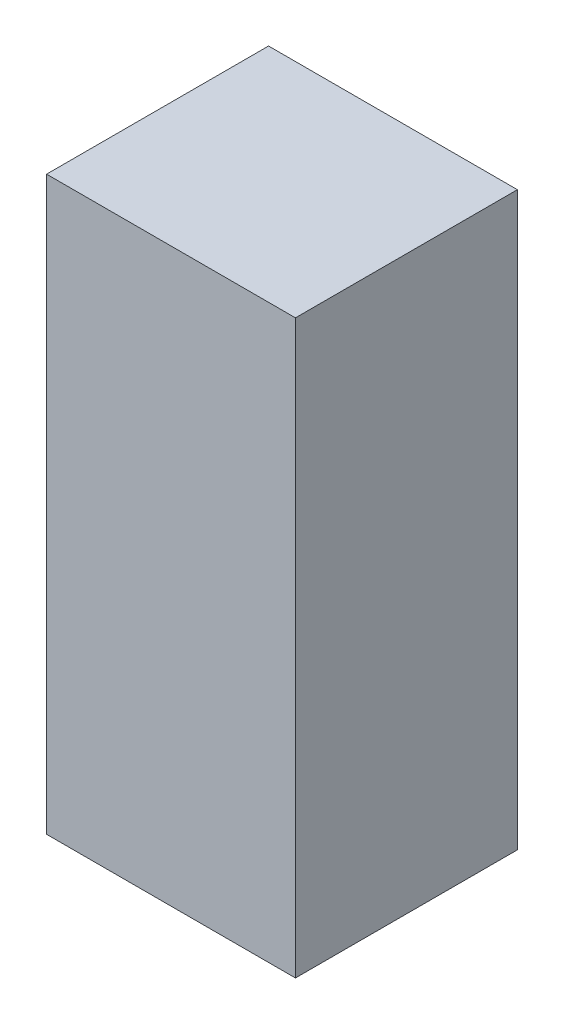
ISO-10303-21;
HEADER;
FILE_DESCRIPTION(('STEP AP214'),'2;1');
FILE_NAME('part.step','',(''),(''),'','','');
FILE_SCHEMA(('AUTOMOTIVE_DESIGN { 1 0 10303 214 1 1 1 1 }'));
ENDSEC;
DATA;
#1=APPLICATION_CONTEXT('core data for automotive mechanical design processes');
#2=APPLICATION_PROTOCOL_DEFINITION('international standard','automotive_design',2000,#1);
#3=PRODUCT_CONTEXT('',#1,'mechanical');
#4=PRODUCT('Part','Part','',(#3));
#5=PRODUCT_RELATED_PRODUCT_CATEGORY('part','',(#4));
#6=PRODUCT_DEFINITION_FORMATION('','',#4);
#7=PRODUCT_DEFINITION_CONTEXT('part definition',#1,'design');
#8=PRODUCT_DEFINITION('design','',#6,#7);
#9=PRODUCT_DEFINITION_SHAPE('','',#8);
#10=(LENGTH_UNIT() NAMED_UNIT(*) SI_UNIT(.MILLI.,.METRE.));
#11=(NAMED_UNIT(*) PLANE_ANGLE_UNIT() SI_UNIT($,.RADIAN.));
#12=(NAMED_UNIT(*) SI_UNIT($,.STERADIAN.) SOLID_ANGLE_UNIT());
#13=UNCERTAINTY_MEASURE_WITH_UNIT(LENGTH_MEASURE(1.E-05),#10,'distance_accuracy_value','');
#14=(GEOMETRIC_REPRESENTATION_CONTEXT(3) GLOBAL_UNCERTAINTY_ASSIGNED_CONTEXT((#13)) GLOBAL_UNIT_ASSIGNED_CONTEXT((#10,
#11,#12)) REPRESENTATION_CONTEXT('',''));
#15=CARTESIAN_POINT('',(0.,0.,0.));
#16=DIRECTION('',(0.,0.,1.));
#17=DIRECTION('',(1.,0.,0.));
#18=AXIS2_PLACEMENT_3D('',#15,#16,#17);
#19=CARTESIAN_POINT('',(18.5,85.,16.5));
#20=DIRECTION('',(-1.,0.,0.));
#21=DIRECTION('',(0.,0.,1.));
#22=AXIS2_PLACEMENT_3D('',#19,#20,#21);
#23=PLANE('',#22);
#24=DIRECTION('',(0.,0.,-1.));
#25=VECTOR('',#24,1.);
#26=CARTESIAN_POINT('',(18.5,0.,16.5));
#27=LINE('',#26,#25);
#28=CARTESIAN_POINT('',(18.5,0.,16.5));
#29=VERTEX_POINT('',#28);
#30=CARTESIAN_POINT('',(18.5,0.,-16.5));
#31=VERTEX_POINT('',#30);
#32=EDGE_CURVE('E105',#29,#31,#27,.T.);
#33=ORIENTED_EDGE('',*,*,#32,.T.);
#34=DIRECTION('',(0.,-1.,0.));
#35=VECTOR('',#34,1.);
#36=CARTESIAN_POINT('',(18.5,85.,-16.5));
#37=LINE('',#36,#35);
#38=CARTESIAN_POINT('',(18.5,85.,-16.5));
#39=VERTEX_POINT('',#38);
#40=EDGE_CURVE('E11',#39,#31,#37,.T.);
#41=ORIENTED_EDGE('',*,*,#40,.F.);
#42=DIRECTION('',(0.,0.,-1.));
#43=VECTOR('',#42,1.);
#44=CARTESIAN_POINT('',(18.5,85.,16.5));
#45=LINE('',#44,#43);
#46=CARTESIAN_POINT('',(18.5,85.,16.5));
#47=VERTEX_POINT('',#46);
#48=EDGE_CURVE('E89',#47,#39,#45,.T.);
#49=ORIENTED_EDGE('',*,*,#48,.F.);
#50=DIRECTION('',(0.,-1.,0.));
#51=VECTOR('',#50,1.);
#52=CARTESIAN_POINT('',(18.5,85.,16.5));
#53=LINE('',#52,#51);
#54=EDGE_CURVE('E101',#47,#29,#53,.T.);
#55=ORIENTED_EDGE('',*,*,#54,.T.);
#56=EDGE_LOOP('',(#33,#41,#49,#55));
#57=FACE_BOUND('',#56,.T.);
#58=ADVANCED_FACE('F37',(#57),#23,.F.);
#59=CARTESIAN_POINT('',(-18.5,85.,-16.5));
#60=DIRECTION('',(0.,0.,1.));
#61=DIRECTION('',(1.,0.,0.));
#62=AXIS2_PLACEMENT_3D('',#59,#60,#61);
#63=PLANE('',#62);
#64=DIRECTION('',(-1.,0.,0.));
#65=VECTOR('',#64,1.);
#66=CARTESIAN_POINT('',(-18.5,0.,-16.5));
#67=LINE('',#66,#65);
#68=CARTESIAN_POINT('',(-18.5,0.,-16.5));
#69=VERTEX_POINT('',#68);
#70=EDGE_CURVE('E94',#31,#69,#67,.T.);
#71=ORIENTED_EDGE('',*,*,#70,.T.);
#72=DIRECTION('',(0.,-1.,0.));
#73=VECTOR('',#72,1.);
#74=CARTESIAN_POINT('',(-18.5,85.,-16.5));
#75=LINE('',#74,#73);
#76=CARTESIAN_POINT('',(-18.5,85.,-16.5));
#77=VERTEX_POINT('',#76);
#78=EDGE_CURVE('E46',#77,#69,#75,.T.);
#79=ORIENTED_EDGE('',*,*,#78,.F.);
#80=DIRECTION('',(-1.,0.,0.));
#81=VECTOR('',#80,1.);
#82=CARTESIAN_POINT('',(-18.5,85.,-16.5));
#83=LINE('',#82,#81);
#84=EDGE_CURVE('E84',#39,#77,#83,.T.);
#85=ORIENTED_EDGE('',*,*,#84,.F.);
#86=ORIENTED_EDGE('',*,*,#40,.T.);
#87=EDGE_LOOP('',(#71,#79,#85,#86));
#88=FACE_BOUND('',#87,.T.);
#89=ADVANCED_FACE('F93',(#88),#63,.F.);
#90=CARTESIAN_POINT('',(-18.5,85.,16.5));
#91=DIRECTION('',(1.,0.,0.));
#92=DIRECTION('',(0.,0.,-1.));
#93=AXIS2_PLACEMENT_3D('',#90,#91,#92);
#94=PLANE('',#93);
#95=DIRECTION('',(0.,0.,1.));
#96=VECTOR('',#95,1.);
#97=CARTESIAN_POINT('',(-18.5,0.,16.5));
#98=LINE('',#97,#96);
#99=CARTESIAN_POINT('',(-18.5,0.,16.5));
#100=VERTEX_POINT('',#99);
#101=EDGE_CURVE('E71',#69,#100,#98,.T.);
#102=ORIENTED_EDGE('',*,*,#101,.T.);
#103=DIRECTION('',(0.,-1.,0.));
#104=VECTOR('',#103,1.);
#105=CARTESIAN_POINT('',(-18.5,85.,16.5));
#106=LINE('',#105,#104);
#107=CARTESIAN_POINT('',(-18.5,85.,16.5));
#108=VERTEX_POINT('',#107);
#109=EDGE_CURVE('E96',#108,#100,#106,.T.);
#110=ORIENTED_EDGE('',*,*,#109,.F.);
#111=DIRECTION('',(0.,0.,1.));
#112=VECTOR('',#111,1.);
#113=CARTESIAN_POINT('',(-18.5,85.,16.5));
#114=LINE('',#113,#112);
#115=EDGE_CURVE('E87',#77,#108,#114,.T.);
#116=ORIENTED_EDGE('',*,*,#115,.F.);
#117=ORIENTED_EDGE('',*,*,#78,.T.);
#118=EDGE_LOOP('',(#102,#110,#116,#117));
#119=FACE_BOUND('',#118,.T.);
#120=ADVANCED_FACE('F97',(#119),#94,.F.);
#121=CARTESIAN_POINT('',(-18.5,85.,16.5));
#122=DIRECTION('',(0.,0.,-1.));
#123=DIRECTION('',(-1.,0.,0.));
#124=AXIS2_PLACEMENT_3D('',#121,#122,#123);
#125=PLANE('',#124);
#126=DIRECTION('',(1.,0.,0.));
#127=VECTOR('',#126,1.);
#128=CARTESIAN_POINT('',(-18.5,0.,16.5));
#129=LINE('',#128,#127);
#130=EDGE_CURVE('E77',#100,#29,#129,.T.);
#131=ORIENTED_EDGE('',*,*,#130,.T.);
#132=ORIENTED_EDGE('',*,*,#54,.F.);
#133=DIRECTION('',(1.,0.,0.));
#134=VECTOR('',#133,1.);
#135=CARTESIAN_POINT('',(-18.5,85.,16.5));
#136=LINE('',#135,#134);
#137=EDGE_CURVE('E54',#108,#47,#136,.T.);
#138=ORIENTED_EDGE('',*,*,#137,.F.);
#139=ORIENTED_EDGE('',*,*,#109,.T.);
#140=EDGE_LOOP('',(#131,#132,#138,#139));
#141=FACE_BOUND('',#140,.T.);
#142=ADVANCED_FACE('F118',(#141),#125,.F.);
#143=CARTESIAN_POINT('',(0.,85.,0.));
#144=DIRECTION('',(0.,-1.,0.));
#145=DIRECTION('',(0.,0.,-1.));
#146=AXIS2_PLACEMENT_3D('',#143,#144,#145);
#147=PLANE('',#146);
#148=ORIENTED_EDGE('',*,*,#48,.T.);
#149=ORIENTED_EDGE('',*,*,#84,.T.);
#150=ORIENTED_EDGE('',*,*,#115,.T.);
#151=ORIENTED_EDGE('',*,*,#137,.T.);
#152=EDGE_LOOP('',(#148,#149,#150,#151));
#153=FACE_BOUND('',#152,.T.);
#154=ADVANCED_FACE('F85',(#153),#147,.F.);
#155=CARTESIAN_POINT('',(0.,0.,0.));
#156=DIRECTION('',(0.,-1.,0.));
#157=DIRECTION('',(0.,0.,-1.));
#158=AXIS2_PLACEMENT_3D('',#155,#156,#157);
#159=PLANE('',#158);
#160=ORIENTED_EDGE('',*,*,#32,.F.);
#161=ORIENTED_EDGE('',*,*,#130,.F.);
#162=ORIENTED_EDGE('',*,*,#101,.F.);
#163=ORIENTED_EDGE('',*,*,#70,.F.);
#164=EDGE_LOOP('',(#160,#161,#162,#163));
#165=FACE_BOUND('',#164,.T.);
#166=ADVANCED_FACE('F121',(#165),#159,.T.);
#167=CLOSED_SHELL('',(#58,#89,#120,#142,#154,#166));
#168=MANIFOLD_SOLID_BREP('B2',#167);
#169=ADVANCED_BREP_SHAPE_REPRESENTATION('',(#18,#168),#14);
#170=SHAPE_DEFINITION_REPRESENTATION(#9,#169);
ENDSEC;
END-ISO-10303-21;
